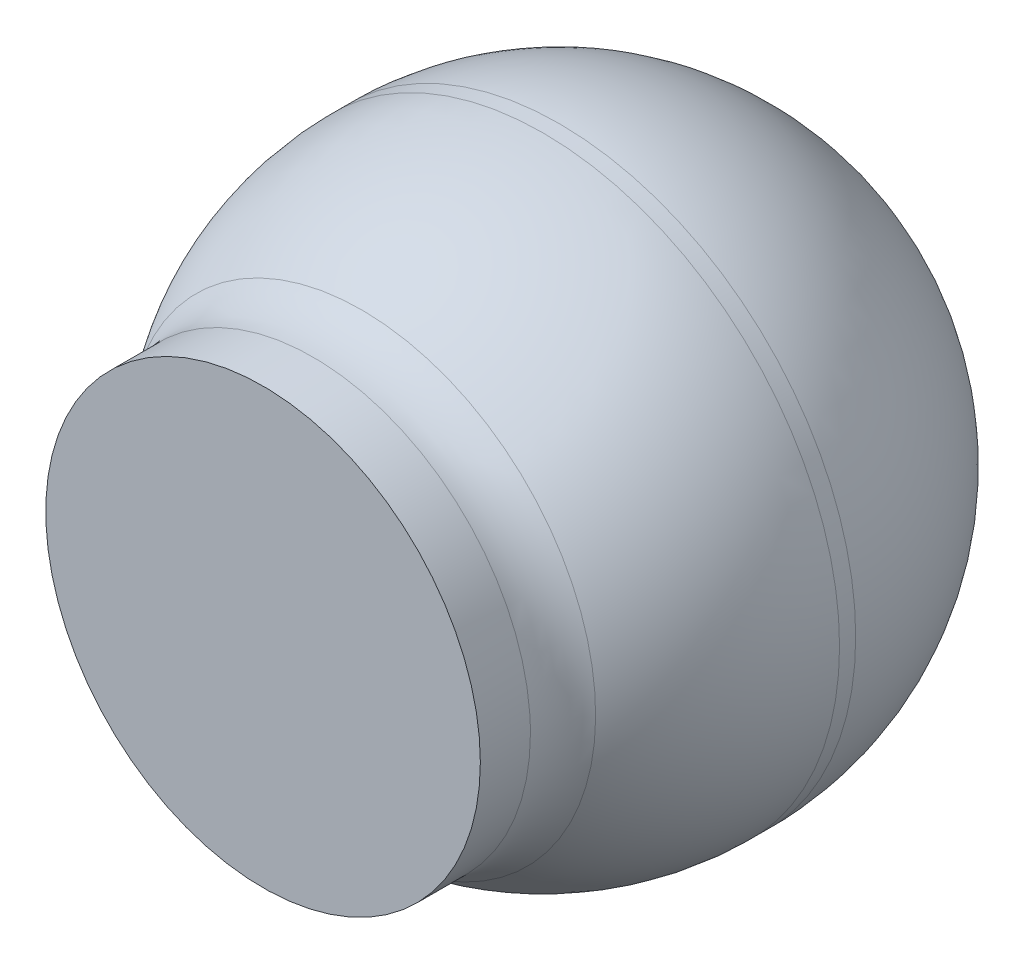
ISO-10303-21;
HEADER;
FILE_DESCRIPTION(('STEP AP214'),'2;1');
FILE_NAME('part.step','',(''),(''),'','','');
FILE_SCHEMA(('AUTOMOTIVE_DESIGN { 1 0 10303 214 1 1 1 1 }'));
ENDSEC;
DATA;
#1=APPLICATION_CONTEXT('core data for automotive mechanical design processes');
#2=APPLICATION_PROTOCOL_DEFINITION('international standard','automotive_design',2000,#1);
#3=PRODUCT_CONTEXT('',#1,'mechanical');
#4=PRODUCT('Part','Part','',(#3));
#5=PRODUCT_RELATED_PRODUCT_CATEGORY('part','',(#4));
#6=PRODUCT_DEFINITION_FORMATION('','',#4);
#7=PRODUCT_DEFINITION_CONTEXT('part definition',#1,'design');
#8=PRODUCT_DEFINITION('design','',#6,#7);
#9=PRODUCT_DEFINITION_SHAPE('','',#8);
#10=(LENGTH_UNIT() NAMED_UNIT(*) SI_UNIT(.MILLI.,.METRE.));
#11=(NAMED_UNIT(*) PLANE_ANGLE_UNIT() SI_UNIT($,.RADIAN.));
#12=(NAMED_UNIT(*) SI_UNIT($,.STERADIAN.) SOLID_ANGLE_UNIT());
#13=UNCERTAINTY_MEASURE_WITH_UNIT(LENGTH_MEASURE(1.E-05),#10,'distance_accuracy_value','');
#14=(GEOMETRIC_REPRESENTATION_CONTEXT(3) GLOBAL_UNCERTAINTY_ASSIGNED_CONTEXT((#13)) GLOBAL_UNIT_ASSIGNED_CONTEXT((#10,
#11,#12)) REPRESENTATION_CONTEXT('',''));
#15=CARTESIAN_POINT('',(0.,0.,0.));
#16=DIRECTION('',(0.,0.,1.));
#17=DIRECTION('',(1.,0.,0.));
#18=AXIS2_PLACEMENT_3D('',#15,#16,#17);
#19=CARTESIAN_POINT('',(-3.102919922269,-6.591349291452,10.006534503384));
#20=DIRECTION('',(0.,0.,-1.));
#21=DIRECTION('',(-1.,0.,0.));
#22=AXIS2_PLACEMENT_3D('',#19,#20,#21);
#23=PLANE('',#22);
#24=CARTESIAN_POINT('',(-3.102919922269,-6.591349291452,10.006534503384));
#25=DIRECTION('',(0.,0.,1.));
#26=DIRECTION('',(1.,0.,0.));
#27=AXIS2_PLACEMENT_3D('',#24,#25,#26);
#28=CIRCLE('',#27,0.275);
#29=CARTESIAN_POINT('',(-2.827919922269,-6.591349291452,10.006534503384));
#30=VERTEX_POINT('',#29);
#31=EDGE_CURVE('E20',#30,#30,#28,.F.);
#32=ORIENTED_EDGE('',*,*,#31,.F.);
#33=EDGE_LOOP('',(#32));
#34=FACE_BOUND('',#33,.T.);
#35=ADVANCED_FACE('F17',(#34),#23,.F.);
#36=CARTESIAN_POINT('',(-3.102919922269,-6.591349291452,9.906534503384));
#37=DIRECTION('',(0.,0.,1.));
#38=DIRECTION('',(1.,0.,0.));
#39=AXIS2_PLACEMENT_3D('',#36,#37,#38);
#40=CYLINDRICAL_SURFACE('',#39,0.275);
#41=CARTESIAN_POINT('',(-3.102919922269,-6.591349291452,9.943180457728));
#42=DIRECTION('',(0.,0.,-1.));
#43=DIRECTION('',(0.996700902337583,0.0811622527992439,0.));
#44=AXIS2_PLACEMENT_3D('',#41,#42,#43);
#45=CIRCLE('',#44,0.275);
#46=CARTESIAN_POINT('',(-2.82882717412616,-6.56902967193221,9.943180457728));
#47=VERTEX_POINT('',#46);
#48=EDGE_CURVE('E65',#47,#47,#45,.F.);
#49=ORIENTED_EDGE('',*,*,#48,.T.);
#50=EDGE_LOOP('',(#49));
#51=FACE_BOUND('',#50,.T.);
#52=ORIENTED_EDGE('',*,*,#31,.T.);
#53=EDGE_LOOP('',(#52));
#54=FACE_BOUND('',#53,.T.);
#55=ADVANCED_FACE('F62',(#51,#54),#40,.T.);
#56=CARTESIAN_POINT('',(-3.102919922269,-6.591349291452,9.943180457728));
#57=DIRECTION('',(0.,0.,-1.));
#58=DIRECTION('',(0.996700902337583,0.0811622527992448,0.));
#59=AXIS2_PLACEMENT_3D('',#56,#57,#58);
#60=TOROIDAL_SURFACE('',#59,0.375,0.1);
#61=ORIENTED_EDGE('',*,*,#48,.F.);
#62=EDGE_LOOP('',(#61));
#63=FACE_BOUND('',#62,.T.);
#64=CARTESIAN_POINT('',(-3.102919922269,-6.591349291452,9.881744931236));
#65=DIRECTION('',(0.,0.,-1.));
#66=DIRECTION('',(-0.996700902337598,-0.0811622527990592,0.));
#67=AXIS2_PLACEMENT_3D('',#64,#65,#66);
#68=CIRCLE('',#67,0.296097046412665);
#69=CARTESIAN_POINT('',(-3.398040115608,-6.615381194786,9.881744931236));
#70=VERTEX_POINT('',#69);
#71=EDGE_CURVE('E39',#70,#70,#68,.T.);
#72=ORIENTED_EDGE('',*,*,#71,.F.);
#73=EDGE_LOOP('',(#72));
#74=FACE_BOUND('',#73,.T.);
#75=ADVANCED_FACE('F57',(#63,#74),#60,.F.);
#76=CARTESIAN_POINT('',(-3.476682760645,-6.621785136252,9.651976062157));
#77=CARTESIAN_POINT('',(-3.476682760645,-6.621785136252,9.701461392103));
#78=CARTESIAN_POINT('',(-3.468526217348,-6.621120941579,9.750947004335));
#79=CARTESIAN_POINT('',(-3.452207085349,-6.619792059952,9.798626332798));
#80=CARTESIAN_POINT('',(-3.428341390838,-6.617848654938,9.842699544317));
#81=CARTESIAN_POINT('',(-3.398040115608,-6.615381194786,9.881744931236));
#82=(BOUNDED_CURVE() B_SPLINE_CURVE(5,(#76,#77,#78,#79,#80,#81),.UNSPECIFIED.,.F.,
.F.) B_SPLINE_CURVE_WITH_KNOTS((6,6),(0.,0.661568582165),
.UNSPECIFIED.) CURVE() GEOMETRIC_REPRESENTATION_ITEM() RATIONAL_B_SPLINE_CURVE((1.,1.,1.,1.,1.,1.)) REPRESENTATION_ITEM(''));
#83=CARTESIAN_POINT('',(-3.102919922269,-6.591349291452,9.651976062157));
#84=DIRECTION('',(0.,0.,-1.));
#85=AXIS1_PLACEMENT('',#83,#84);
#86=SURFACE_OF_REVOLUTION('',#82,#85);
#87=CARTESIAN_POINT('',(-3.102919922269,-6.591349291452,9.651976062157));
#88=DIRECTION('',(0.,0.,1.));
#89=DIRECTION('',(1.,0.,0.));
#90=AXIS2_PLACEMENT_3D('',#87,#88,#89);
#91=CIRCLE('',#90,0.375);
#92=CARTESIAN_POINT('',(-2.727919922269,-6.591349291452,9.651976062157));
#93=VERTEX_POINT('',#92);
#94=EDGE_CURVE('E36',#93,#93,#91,.F.);
#95=ORIENTED_EDGE('',*,*,#94,.F.);
#96=EDGE_LOOP('',(#95));
#97=FACE_BOUND('',#96,.T.);
#98=ORIENTED_EDGE('',*,*,#71,.T.);
#99=EDGE_LOOP('',(#98));
#100=FACE_BOUND('',#99,.T.);
#101=ADVANCED_FACE('F53',(#97,#100),#86,.F.);
#102=CARTESIAN_POINT('',(-3.102919922269,-6.591349291452,9.256534503384));
#103=DIRECTION('',(0.,0.,1.));
#104=DIRECTION('',(1.,0.,0.));
#105=AXIS2_PLACEMENT_3D('',#102,#103,#104);
#106=CYLINDRICAL_SURFACE('',#105,0.375);
#107=CARTESIAN_POINT('',(-3.102919922269,-6.591349291452,9.631534503384));
#108=DIRECTION('',(0.,0.,-1.));
#109=DIRECTION('',(0.0811622527992357,-0.996700902337583,0.));
#110=AXIS2_PLACEMENT_3D('',#107,#108,#109);
#111=CIRCLE('',#110,0.375);
#112=CARTESIAN_POINT('',(-3.07248407746929,-6.96511212982859,9.631534503384));
#113=VERTEX_POINT('',#112);
#114=CARTESIAN_POINT('',(-3.13335576706871,-6.21758645307541,9.631534503384));
#115=VERTEX_POINT('',#114);
#116=EDGE_CURVE('E11',#113,#115,#111,.T.);
#117=ORIENTED_EDGE('',*,*,#116,.F.);
#118=CARTESIAN_POINT('',(-3.102919922269,-6.591349291452,9.631534503384));
#119=DIRECTION('',(0.,0.,1.));
#120=DIRECTION('',(0.0811622527992365,-0.996700902337583,0.));
#121=AXIS2_PLACEMENT_3D('',#118,#119,#120);
#122=CIRCLE('',#121,0.375);
#123=EDGE_CURVE('E25',#115,#113,#122,.F.);
#124=ORIENTED_EDGE('',*,*,#123,.F.);
#125=EDGE_LOOP('',(#117,#124));
#126=FACE_BOUND('',#125,.T.);
#127=ORIENTED_EDGE('',*,*,#94,.T.);
#128=EDGE_LOOP('',(#127));
#129=FACE_BOUND('',#128,.T.);
#130=ADVANCED_FACE('F34',(#126,#129),#106,.T.);
#131=CARTESIAN_POINT('',(-3.102919922269,-6.591349291452,9.631534503384));
#132=DIRECTION('',(0.0811622527992361,-0.996700902337583,0.));
#133=DIRECTION('',(-0.996700902337583,-0.0811622527992361,0.));
#134=AXIS2_PLACEMENT_3D('',#131,#132,#133);
#135=SPHERICAL_SURFACE('',#134,0.375);
#136=ORIENTED_EDGE('',*,*,#123,.T.);
#137=ORIENTED_EDGE('',*,*,#116,.T.);
#138=EDGE_LOOP('',(#136,#137));
#139=FACE_BOUND('',#138,.T.);
#140=ADVANCED_FACE('F32',(#139),#135,.T.);
#141=CLOSED_SHELL('',(#35,#55,#75,#101,#130,#140));
#142=MANIFOLD_SOLID_BREP('B1',#141);
#143=ADVANCED_BREP_SHAPE_REPRESENTATION('',(#18,#142),#14);
#144=SHAPE_DEFINITION_REPRESENTATION(#9,#143);
ENDSEC;
END-ISO-10303-21;
